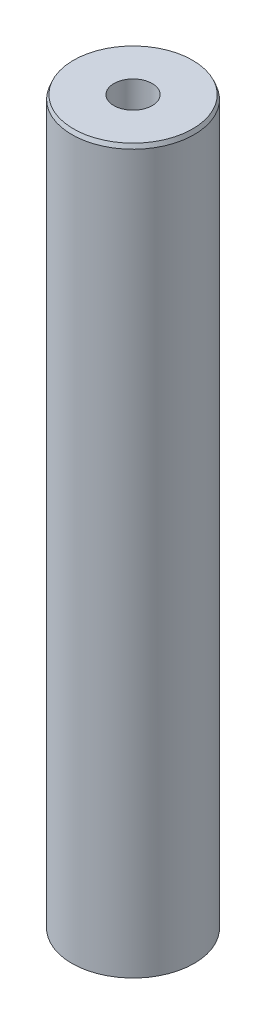
ISO-10303-21;
HEADER;
FILE_DESCRIPTION(('STEP AP214'),'2;1');
FILE_NAME('part.step','',(''),(''),'','','');
FILE_SCHEMA(('AUTOMOTIVE_DESIGN { 1 0 10303 214 1 1 1 1 }'));
ENDSEC;
DATA;
#1=APPLICATION_CONTEXT('core data for automotive mechanical design processes');
#2=APPLICATION_PROTOCOL_DEFINITION('international standard','automotive_design',2000,#1);
#3=PRODUCT_CONTEXT('',#1,'mechanical');
#4=PRODUCT('Part','Part','',(#3));
#5=PRODUCT_RELATED_PRODUCT_CATEGORY('part','',(#4));
#6=PRODUCT_DEFINITION_FORMATION('','',#4);
#7=PRODUCT_DEFINITION_CONTEXT('part definition',#1,'design');
#8=PRODUCT_DEFINITION('design','',#6,#7);
#9=PRODUCT_DEFINITION_SHAPE('','',#8);
#10=(LENGTH_UNIT() NAMED_UNIT(*) SI_UNIT(.MILLI.,.METRE.));
#11=(NAMED_UNIT(*) PLANE_ANGLE_UNIT() SI_UNIT($,.RADIAN.));
#12=(NAMED_UNIT(*) SI_UNIT($,.STERADIAN.) SOLID_ANGLE_UNIT());
#13=UNCERTAINTY_MEASURE_WITH_UNIT(LENGTH_MEASURE(1.E-05),#10,'distance_accuracy_value','');
#14=(GEOMETRIC_REPRESENTATION_CONTEXT(3) GLOBAL_UNCERTAINTY_ASSIGNED_CONTEXT((#13)) GLOBAL_UNIT_ASSIGNED_CONTEXT((#10,
#11,#12)) REPRESENTATION_CONTEXT('',''));
#15=CARTESIAN_POINT('',(0.,0.,0.));
#16=DIRECTION('',(0.,0.,1.));
#17=DIRECTION('',(1.,0.,0.));
#18=AXIS2_PLACEMENT_3D('',#15,#16,#17);
#19=CARTESIAN_POINT('',(0.,147.868276383391,0.));
#20=DIRECTION('',(0.,-1.,0.));
#21=DIRECTION('',(0.,0.,-1.));
#22=AXIS2_PLACEMENT_3D('',#19,#20,#21);
#23=CYLINDRICAL_SURFACE('',#22,12.5);
#24=CARTESIAN_POINT('',(0.,147.021975363011,0.));
#25=DIRECTION('',(0.,1.,0.));
#26=DIRECTION('',(0.,0.,1.));
#27=AXIS2_PLACEMENT_3D('',#24,#25,#26);
#28=CIRCLE('',#27,12.5);
#29=CARTESIAN_POINT('',(0.,147.021975363011,-12.5));
#30=VERTEX_POINT('',#29);
#31=EDGE_CURVE('E50',#30,#30,#28,.F.);
#32=ORIENTED_EDGE('',*,*,#31,.T.);
#33=EDGE_LOOP('',(#32));
#34=FACE_BOUND('',#33,.T.);
#35=CARTESIAN_POINT('',(0.,0.333130984401048,0.));
#36=DIRECTION('',(0.,1.,0.));
#37=DIRECTION('',(0.,0.,1.));
#38=AXIS2_PLACEMENT_3D('',#35,#36,#37);
#39=CIRCLE('',#38,12.5);
#40=CARTESIAN_POINT('',(0.,0.333130984401048,12.5));
#41=VERTEX_POINT('',#40);
#42=EDGE_CURVE('E51',#41,#41,#39,.T.);
#43=ORIENTED_EDGE('',*,*,#42,.T.);
#44=EDGE_LOOP('',(#43));
#45=FACE_BOUND('',#44,.T.);
#46=ADVANCED_FACE('F39',(#34,#45),#23,.T.);
#47=CARTESIAN_POINT('',(0.,147.868276383391,0.));
#48=DIRECTION('',(0.,1.,0.));
#49=DIRECTION('',(0.,0.,1.));
#50=AXIS2_PLACEMENT_3D('',#47,#48,#49);
#51=PLANE('',#50);
#52=CARTESIAN_POINT('',(0.,147.868276383391,0.));
#53=DIRECTION('',(0.,1.,0.));
#54=DIRECTION('',(0.,0.,1.));
#55=AXIS2_PLACEMENT_3D('',#52,#53,#54);
#56=CIRCLE('',#55,12.1668690155989);
#57=CARTESIAN_POINT('',(0.,147.868276383391,-12.1668690155989));
#58=VERTEX_POINT('',#57);
#59=EDGE_CURVE('E54',#58,#58,#56,.T.);
#60=ORIENTED_EDGE('',*,*,#59,.T.);
#61=EDGE_LOOP('',(#60));
#62=FACE_BOUND('',#61,.T.);
#63=CARTESIAN_POINT('',(0.,147.868276383391,0.));
#64=DIRECTION('',(0.,1.,0.));
#65=DIRECTION('',(0.,0.,1.));
#66=AXIS2_PLACEMENT_3D('',#63,#64,#65);
#67=CIRCLE('',#66,3.91979737862457);
#68=CARTESIAN_POINT('',(0.,147.868276383391,3.91979737862457));
#69=VERTEX_POINT('',#68);
#70=EDGE_CURVE('E58',#69,#69,#67,.T.);
#71=ORIENTED_EDGE('',*,*,#70,.F.);
#72=EDGE_LOOP('',(#71));
#73=FACE_BOUND('',#72,.T.);
#74=ADVANCED_FACE('F69',(#62,#73),#51,.T.);
#75=CARTESIAN_POINT('',(0.,0.,0.));
#76=DIRECTION('',(0.,1.,0.));
#77=DIRECTION('',(0.,0.,1.));
#78=AXIS2_PLACEMENT_3D('',#75,#76,#77);
#79=PLANE('',#78);
#80=CARTESIAN_POINT('',(0.,0.,0.));
#81=DIRECTION('',(0.,1.,0.));
#82=DIRECTION('',(0.,0.,1.));
#83=AXIS2_PLACEMENT_3D('',#80,#81,#82);
#84=CIRCLE('',#83,11.6536989796203);
#85=CARTESIAN_POINT('',(0.,0.,11.6536989796203));
#86=VERTEX_POINT('',#85);
#87=EDGE_CURVE('E10',#86,#86,#84,.F.);
#88=ORIENTED_EDGE('',*,*,#87,.T.);
#89=EDGE_LOOP('',(#88));
#90=FACE_BOUND('',#89,.T.);
#91=CARTESIAN_POINT('',(0.,0.,0.));
#92=DIRECTION('',(0.,1.,0.));
#93=DIRECTION('',(0.,0.,1.));
#94=AXIS2_PLACEMENT_3D('',#91,#92,#93);
#95=CIRCLE('',#94,3.91979737862457);
#96=CARTESIAN_POINT('',(0.,0.,3.91979737862457));
#97=VERTEX_POINT('',#96);
#98=EDGE_CURVE('E63',#97,#97,#95,.T.);
#99=ORIENTED_EDGE('',*,*,#98,.T.);
#100=EDGE_LOOP('',(#99));
#101=FACE_BOUND('',#100,.T.);
#102=ADVANCED_FACE('F75',(#90,#101),#79,.F.);
#103=CARTESIAN_POINT('',(0.,147.868276383391,0.));
#104=DIRECTION('',(0.,-1.,0.));
#105=DIRECTION('',(0.,0.,-1.));
#106=AXIS2_PLACEMENT_3D('',#103,#104,#105);
#107=CYLINDRICAL_SURFACE('',#106,3.91979737862457);
#108=ORIENTED_EDGE('',*,*,#70,.T.);
#109=EDGE_LOOP('',(#108));
#110=FACE_BOUND('',#109,.T.);
#111=ORIENTED_EDGE('',*,*,#98,.F.);
#112=EDGE_LOOP('',(#111));
#113=FACE_BOUND('',#112,.T.);
#114=ADVANCED_FACE('F70',(#110,#113),#107,.F.);
#115=CARTESIAN_POINT('',(0.,147.868276383391,0.));
#116=DIRECTION('',(0.,-1.,0.));
#117=DIRECTION('',(0.,0.,-1.));
#118=AXIS2_PLACEMENT_3D('',#115,#116,#117);
#119=CONICAL_SURFACE('',#118,12.1668690155989,0.375004513413328);
#120=CARTESIAN_POINT('',(0.,147.021975363011,-12.5));
#121=CARTESIAN_POINT('',(0.,147.03079099864,-12.4965298855792));
#122=CARTESIAN_POINT('',(0.,147.039606634269,-12.4930597711583));
#123=CARTESIAN_POINT('',(0.,147.057237905527,-12.4861195423166));
#124=CARTESIAN_POINT('',(0.,147.066053541156,-12.4826494278958));
#125=CARTESIAN_POINT('',(0.,147.083684812414,-12.4757091990541));
#126=CARTESIAN_POINT('',(0.,147.092500448043,-12.4722390846333));
#127=CARTESIAN_POINT('',(0.,147.1101317193,-12.4652988557916));
#128=CARTESIAN_POINT('',(0.,147.118947354929,-12.4618287413707));
#129=CARTESIAN_POINT('',(0.,147.136578626187,-12.454888512529));
#130=CARTESIAN_POINT('',(0.,147.145394261816,-12.4514183981082));
#131=CARTESIAN_POINT('',(0.,147.163025533074,-12.4444781692665));
#132=CARTESIAN_POINT('',(0.,147.171841168703,-12.4410080548456));
#133=CARTESIAN_POINT('',(0.,147.189472439961,-12.434067826004));
#134=CARTESIAN_POINT('',(0.,147.19828807559,-12.4305977115831));
#135=CARTESIAN_POINT('',(0.,147.215919346848,-12.4236574827414));
#136=CARTESIAN_POINT('',(0.,147.224734982477,-12.4201873683206));
#137=CARTESIAN_POINT('',(0.,147.242366253735,-12.4132471394789));
#138=CARTESIAN_POINT('',(0.,147.251181889364,-12.4097770250581));
#139=CARTESIAN_POINT('',(0.,147.268813160622,-12.4028367962164));
#140=CARTESIAN_POINT('',(0.,147.277628796251,-12.3993666817955));
#141=CARTESIAN_POINT('',(0.,147.295260067509,-12.3924264529538));
#142=CARTESIAN_POINT('',(0.,147.304075703137,-12.388956338533));
#143=CARTESIAN_POINT('',(0.,147.321706974395,-12.3820161096913));
#144=CARTESIAN_POINT('',(0.,147.330522610024,-12.3785459952704));
#145=CARTESIAN_POINT('',(0.,147.348153881282,-12.3716057664288));
#146=CARTESIAN_POINT('',(0.,147.356969516911,-12.3681356520079));
#147=CARTESIAN_POINT('',(0.,147.374600788169,-12.3611954231662));
#148=CARTESIAN_POINT('',(0.,147.383416423798,-12.3577253087454));
#149=CARTESIAN_POINT('',(0.,147.401047695056,-12.3507850799037));
#150=CARTESIAN_POINT('',(0.,147.409863330685,-12.3473149654829));
#151=CARTESIAN_POINT('',(0.,147.427494601943,-12.3403747366412));
#152=CARTESIAN_POINT('',(0.,147.436310237572,-12.3369046222203));
#153=CARTESIAN_POINT('',(0.,147.45394150883,-12.3299643933786));
#154=CARTESIAN_POINT('',(0.,147.462757144459,-12.3264942789578));
#155=CARTESIAN_POINT('',(0.,147.480388415717,-12.3195540501161));
#156=CARTESIAN_POINT('',(0.,147.489204051346,-12.3160839356952));
#157=CARTESIAN_POINT('',(0.,147.506835322603,-12.3091437068536));
#158=CARTESIAN_POINT('',(0.,147.515650958232,-12.3056735924327));
#159=CARTESIAN_POINT('',(0.,147.53328222949,-12.298733363591));
#160=CARTESIAN_POINT('',(0.,147.542097865119,-12.2952632491702));
#161=CARTESIAN_POINT('',(0.,147.559729136377,-12.2883230203285));
#162=CARTESIAN_POINT('',(0.,147.568544772006,-12.2848529059076));
#163=CARTESIAN_POINT('',(0.,147.586176043264,-12.277912677066));
#164=CARTESIAN_POINT('',(0.,147.594991678893,-12.2744425626451));
#165=CARTESIAN_POINT('',(0.,147.612622950151,-12.2675023338034));
#166=CARTESIAN_POINT('',(0.,147.62143858578,-12.2640322193826));
#167=CARTESIAN_POINT('',(0.,147.639069857038,-12.2570919905409));
#168=CARTESIAN_POINT('',(0.,147.647885492667,-12.25362187612));
#169=CARTESIAN_POINT('',(0.,147.665516763925,-12.2466816472784));
#170=CARTESIAN_POINT('',(0.,147.674332399554,-12.2432115328575));
#171=CARTESIAN_POINT('',(0.,147.691963670812,-12.2362713040158));
#172=CARTESIAN_POINT('',(0.,147.70077930644,-12.232801189595));
#173=CARTESIAN_POINT('',(0.,147.718410577698,-12.2258609607533));
#174=CARTESIAN_POINT('',(0.,147.727226213327,-12.2223908463324));
#175=CARTESIAN_POINT('',(0.,147.744857484585,-12.2154506174908));
#176=CARTESIAN_POINT('',(0.,147.753673120214,-12.2119805030699));
#177=CARTESIAN_POINT('',(0.,147.771304391472,-12.2050402742282));
#178=CARTESIAN_POINT('',(0.,147.780120027101,-12.2015701598074));
#179=CARTESIAN_POINT('',(0.,147.797751298359,-12.1946299309657));
#180=CARTESIAN_POINT('',(0.,147.806566933988,-12.1911598165448));
#181=CARTESIAN_POINT('',(0.,147.824198205246,-12.1842195877032));
#182=CARTESIAN_POINT('',(0.,147.833013840875,-12.1807494732823));
#183=CARTESIAN_POINT('',(0.,147.850645112133,-12.1738092444406));
#184=CARTESIAN_POINT('',(0.,147.859460747762,-12.1703391300198));
#185=CARTESIAN_POINT('',(0.,147.868276383391,-12.1668690155989));
#186=B_SPLINE_CURVE_WITH_KNOTS('',3,(#120,#121,#122,#123,#124,#125,#126,#127,#128,#129,#130,
#131,#132,#133,#134,#135,#136,#137,#138,#139,#140,#141,#142,#143,#144,#145,#146,#147,#148,#149,
#150,#151,#152,#153,#154,#155,#156,#157,#158,#159,#160,#161,#162,#163,#164,#165,#166,#167,#168,
#169,#170,#171,#172,#173,#174,#175,#176,#177,#178,#179,#180,#181,#182,#183,#184,#185),
.UNSPECIFIED.,.F.,.F.,(4,2,2,2,2,2,2,2,2,2,2,2,2,2,2,2,2,2,2,2,2,2,2,2,2,2,2,2,2,2,2,2,4),(0.,
0.0284220711899628,0.0568441423798998,0.0852662135698627,0.1136882847598,0.142110355949737,
0.170532427139699,0.198954498329636,0.227376569519573,0.255798640709536,0.284220711899473,
0.312642783089435,0.341064854279372,0.369486925469309,0.397908996659272,0.426331067849209,
0.454753139039146,0.483175210229109,0.511597281419046,0.540019352609009,0.568441423798946,
0.596863494988883,0.625285566178845,0.653707637368782,0.682129708558745,0.710551779748682,
0.738973850938619,0.767395922128582,0.795817993318519,0.824240064508456,0.852662135698419,
0.881084206888356,0.909506278078319),.UNSPECIFIED.);
#187=EDGE_CURVE('BSEAM81',#30,#58,#186,.T.);
#188=ORIENTED_EDGE('',*,*,#31,.F.);
#189=ORIENTED_EDGE('',*,*,#59,.F.);
#190=ORIENTED_EDGE('',*,*,#187,.T.);
#191=ORIENTED_EDGE('',*,*,#187,.F.);
#192=EDGE_LOOP('',(#188,#190,#189,#191));
#193=FACE_BOUND('',#192,.T.);
#194=ADVANCED_FACE('F81',(#193),#119,.T.);
#195=CARTESIAN_POINT('',(0.,0.333130984401048,0.));
#196=DIRECTION('',(0.,1.,0.));
#197=DIRECTION('',(0.,0.,1.));
#198=AXIS2_PLACEMENT_3D('',#195,#196,#197);
#199=CONICAL_SURFACE('',#198,12.5,1.19579181338157);
#200=ORIENTED_EDGE('',*,*,#87,.F.);
#201=EDGE_LOOP('',(#200));
#202=FACE_BOUND('',#201,.T.);
#203=ORIENTED_EDGE('',*,*,#42,.F.);
#204=EDGE_LOOP('',(#203));
#205=FACE_BOUND('',#204,.T.);
#206=ADVANCED_FACE('F45',(#202,#205),#199,.T.);
#207=CLOSED_SHELL('',(#46,#74,#102,#114,#194,#206));
#208=MANIFOLD_SOLID_BREP('B2',#207);
#209=ADVANCED_BREP_SHAPE_REPRESENTATION('',(#18,#208),#14);
#210=SHAPE_DEFINITION_REPRESENTATION(#9,#209);
ENDSEC;
END-ISO-10303-21;
